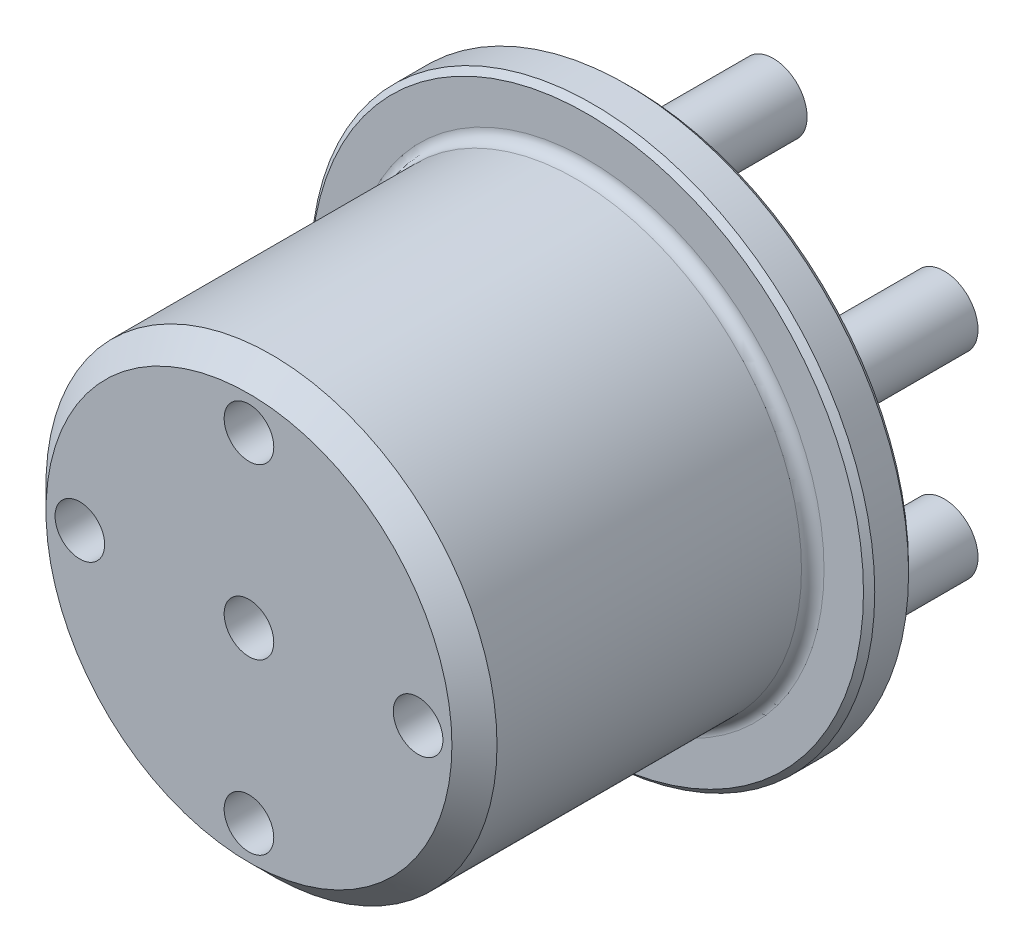
ISO-10303-21;
HEADER;
FILE_DESCRIPTION(('STEP AP214'),'2;1');
FILE_NAME('part.step','',(''),(''),'','','');
FILE_SCHEMA(('AUTOMOTIVE_DESIGN { 1 0 10303 214 1 1 1 1 }'));
ENDSEC;
DATA;
#1=APPLICATION_CONTEXT('core data for automotive mechanical design processes');
#2=APPLICATION_PROTOCOL_DEFINITION('international standard','automotive_design',2000,#1);
#3=PRODUCT_CONTEXT('',#1,'mechanical');
#4=PRODUCT('Part','Part','',(#3));
#5=PRODUCT_RELATED_PRODUCT_CATEGORY('part','',(#4));
#6=PRODUCT_DEFINITION_FORMATION('','',#4);
#7=PRODUCT_DEFINITION_CONTEXT('part definition',#1,'design');
#8=PRODUCT_DEFINITION('design','',#6,#7);
#9=PRODUCT_DEFINITION_SHAPE('','',#8);
#10=(LENGTH_UNIT() NAMED_UNIT(*) SI_UNIT(.MILLI.,.METRE.));
#11=(NAMED_UNIT(*) PLANE_ANGLE_UNIT() SI_UNIT($,.RADIAN.));
#12=(NAMED_UNIT(*) SI_UNIT($,.STERADIAN.) SOLID_ANGLE_UNIT());
#13=UNCERTAINTY_MEASURE_WITH_UNIT(LENGTH_MEASURE(1.E-05),#10,'distance_accuracy_value','');
#14=(GEOMETRIC_REPRESENTATION_CONTEXT(3) GLOBAL_UNCERTAINTY_ASSIGNED_CONTEXT((#13)) GLOBAL_UNIT_ASSIGNED_CONTEXT((#10,
#11,#12)) REPRESENTATION_CONTEXT('',''));
#15=CARTESIAN_POINT('',(0.,0.,0.));
#16=DIRECTION('',(0.,0.,1.));
#17=DIRECTION('',(1.,0.,0.));
#18=AXIS2_PLACEMENT_3D('',#15,#16,#17);
#19=CARTESIAN_POINT('',(0.,0.,-4.));
#20=DIRECTION('',(0.,0.,1.));
#21=DIRECTION('',(1.,0.,0.));
#22=AXIS2_PLACEMENT_3D('',#19,#20,#21);
#23=CYLINDRICAL_SURFACE('',#22,25.);
#24=CARTESIAN_POINT('',(0.,0.,-3.50000000000001));
#25=DIRECTION('',(0.,0.,1.));
#26=DIRECTION('',(1.,0.,0.));
#27=AXIS2_PLACEMENT_3D('',#24,#25,#26);
#28=CIRCLE('',#27,25.);
#29=CARTESIAN_POINT('',(25.,0.,-3.50000000000001));
#30=VERTEX_POINT('',#29);
#31=EDGE_CURVE('E206',#30,#30,#28,.T.);
#32=ORIENTED_EDGE('',*,*,#31,.T.);
#33=EDGE_LOOP('',(#32));
#34=FACE_BOUND('',#33,.T.);
#35=CARTESIAN_POINT('',(0.,0.,-0.499999999999997));
#36=DIRECTION('',(0.,0.,1.));
#37=DIRECTION('',(1.,0.,0.));
#38=AXIS2_PLACEMENT_3D('',#35,#36,#37);
#39=CIRCLE('',#38,25.);
#40=CARTESIAN_POINT('',(25.,0.,-0.499999999999997));
#41=VERTEX_POINT('',#40);
#42=EDGE_CURVE('E202',#41,#41,#39,.F.);
#43=ORIENTED_EDGE('',*,*,#42,.T.);
#44=EDGE_LOOP('',(#43));
#45=FACE_BOUND('',#44,.T.);
#46=ADVANCED_FACE('F47',(#34,#45),#23,.T.);
#47=CARTESIAN_POINT('',(0.,0.,-4.));
#48=DIRECTION('',(0.,0.,1.));
#49=DIRECTION('',(1.,0.,0.));
#50=AXIS2_PLACEMENT_3D('',#47,#48,#49);
#51=PLANE('',#50);
#52=CARTESIAN_POINT('',(0.,0.,-4.));
#53=DIRECTION('',(0.,0.,1.));
#54=DIRECTION('',(1.,0.,0.));
#55=AXIS2_PLACEMENT_3D('',#52,#53,#54);
#56=CIRCLE('',#55,24.5);
#57=CARTESIAN_POINT('',(24.5,0.,-4.));
#58=VERTEX_POINT('',#57);
#59=EDGE_CURVE('E214',#58,#58,#56,.F.);
#60=ORIENTED_EDGE('',*,*,#59,.T.);
#61=EDGE_LOOP('',(#60));
#62=FACE_BOUND('',#61,.T.);
#63=CARTESIAN_POINT('',(0.,0.,-4.));
#64=DIRECTION('',(0.,0.,1.));
#65=DIRECTION('',(1.,0.,0.));
#66=AXIS2_PLACEMENT_3D('',#63,#64,#65);
#67=CIRCLE('',#66,10.7);
#68=CARTESIAN_POINT('',(10.7,0.,-4.));
#69=VERTEX_POINT('',#68);
#70=EDGE_CURVE('E210',#69,#69,#67,.T.);
#71=ORIENTED_EDGE('',*,*,#70,.T.);
#72=EDGE_LOOP('',(#71));
#73=FACE_BOUND('',#72,.T.);
#74=CARTESIAN_POINT('',(15.1554445662276,8.75000000000018,-4.));
#75=DIRECTION('',(0.,0.,1.));
#76=DIRECTION('',(1.,0.,0.));
#77=AXIS2_PLACEMENT_3D('',#74,#75,#76);
#78=CIRCLE('',#77,4.);
#79=CARTESIAN_POINT('',(19.1554445662276,8.75000000000018,-4.));
#80=VERTEX_POINT('',#79);
#81=EDGE_CURVE('E178',#80,#80,#78,.T.);
#82=ORIENTED_EDGE('',*,*,#81,.T.);
#83=EDGE_LOOP('',(#82));
#84=FACE_BOUND('',#83,.T.);
#85=CARTESIAN_POINT('',(0.,17.5,-4.));
#86=DIRECTION('',(0.,0.,1.));
#87=DIRECTION('',(1.,0.,0.));
#88=AXIS2_PLACEMENT_3D('',#85,#86,#87);
#89=CIRCLE('',#88,4.);
#90=CARTESIAN_POINT('',(4.,17.5,-4.));
#91=VERTEX_POINT('',#90);
#92=EDGE_CURVE('E174',#91,#91,#89,.T.);
#93=ORIENTED_EDGE('',*,*,#92,.T.);
#94=EDGE_LOOP('',(#93));
#95=FACE_BOUND('',#94,.T.);
#96=CARTESIAN_POINT('',(-15.1554445662277,8.74999999999997,-4.));
#97=DIRECTION('',(0.,0.,1.));
#98=DIRECTION('',(1.,0.,0.));
#99=AXIS2_PLACEMENT_3D('',#96,#97,#98);
#100=CIRCLE('',#99,4.);
#101=CARTESIAN_POINT('',(-11.1554445662277,8.74999999999997,-4.));
#102=VERTEX_POINT('',#101);
#103=EDGE_CURVE('E170',#102,#102,#100,.T.);
#104=ORIENTED_EDGE('',*,*,#103,.T.);
#105=EDGE_LOOP('',(#104));
#106=FACE_BOUND('',#105,.T.);
#107=CARTESIAN_POINT('',(-15.1554445662276,-8.75000000000007,-4.));
#108=DIRECTION('',(0.,0.,1.));
#109=DIRECTION('',(1.,0.,0.));
#110=AXIS2_PLACEMENT_3D('',#107,#108,#109);
#111=CIRCLE('',#110,4.);
#112=CARTESIAN_POINT('',(-11.1554445662276,-8.75000000000007,-4.));
#113=VERTEX_POINT('',#112);
#114=EDGE_CURVE('E166',#113,#113,#111,.T.);
#115=ORIENTED_EDGE('',*,*,#114,.T.);
#116=EDGE_LOOP('',(#115));
#117=FACE_BOUND('',#116,.T.);
#118=CARTESIAN_POINT('',(1.2220184685951E-13,-17.5,-4.));
#119=DIRECTION('',(0.,0.,1.));
#120=DIRECTION('',(1.,0.,0.));
#121=AXIS2_PLACEMENT_3D('',#118,#119,#120);
#122=CIRCLE('',#121,4.);
#123=CARTESIAN_POINT('',(4.00000000000012,-17.5,-4.));
#124=VERTEX_POINT('',#123);
#125=EDGE_CURVE('E162',#124,#124,#122,.T.);
#126=ORIENTED_EDGE('',*,*,#125,.T.);
#127=EDGE_LOOP('',(#126));
#128=FACE_BOUND('',#127,.T.);
#129=CARTESIAN_POINT('',(15.1554445662277,-8.75000000000001,-4.));
#130=DIRECTION('',(0.,0.,1.));
#131=DIRECTION('',(1.,0.,0.));
#132=AXIS2_PLACEMENT_3D('',#129,#130,#131);
#133=CIRCLE('',#132,4.);
#134=CARTESIAN_POINT('',(19.1554445662277,-8.75000000000001,-4.));
#135=VERTEX_POINT('',#134);
#136=EDGE_CURVE('E158',#135,#135,#133,.T.);
#137=ORIENTED_EDGE('',*,*,#136,.T.);
#138=EDGE_LOOP('',(#137));
#139=FACE_BOUND('',#138,.T.);
#140=ADVANCED_FACE('F251',(#62,#73,#84,#95,#106,#117,#128,#139),#51,.F.);
#141=CARTESIAN_POINT('',(0.,0.,0.));
#142=DIRECTION('',(0.,0.,1.));
#143=DIRECTION('',(1.,0.,0.));
#144=AXIS2_PLACEMENT_3D('',#141,#142,#143);
#145=PLANE('',#144);
#146=CARTESIAN_POINT('',(0.,0.,0.));
#147=DIRECTION('',(0.,0.,1.));
#148=DIRECTION('',(1.,0.,0.));
#149=AXIS2_PLACEMENT_3D('',#146,#147,#148);
#150=CIRCLE('',#149,24.5);
#151=CARTESIAN_POINT('',(24.5,0.,0.));
#152=VERTEX_POINT('',#151);
#153=EDGE_CURVE('E230',#152,#152,#150,.T.);
#154=ORIENTED_EDGE('',*,*,#153,.T.);
#155=EDGE_LOOP('',(#154));
#156=FACE_BOUND('',#155,.T.);
#157=CARTESIAN_POINT('',(0.,0.,0.));
#158=DIRECTION('',(0.,0.,1.));
#159=DIRECTION('',(1.,0.,0.));
#160=AXIS2_PLACEMENT_3D('',#157,#158,#159);
#161=CIRCLE('',#160,21.);
#162=CARTESIAN_POINT('',(21.,0.,0.));
#163=VERTEX_POINT('',#162);
#164=EDGE_CURVE('E150',#163,#163,#161,.F.);
#165=ORIENTED_EDGE('',*,*,#164,.T.);
#166=EDGE_LOOP('',(#165));
#167=FACE_BOUND('',#166,.T.);
#168=ADVANCED_FACE('F258',(#156,#167),#145,.T.);
#169=CARTESIAN_POINT('',(0.,0.,30.));
#170=DIRECTION('',(0.,0.,-1.));
#171=DIRECTION('',(-1.,0.,0.));
#172=AXIS2_PLACEMENT_3D('',#169,#170,#171);
#173=CYLINDRICAL_SURFACE('',#172,20.);
#174=CARTESIAN_POINT('',(0.,0.,28.));
#175=DIRECTION('',(0.,0.,1.));
#176=DIRECTION('',(1.,0.,0.));
#177=AXIS2_PLACEMENT_3D('',#174,#175,#176);
#178=CIRCLE('',#177,20.);
#179=CARTESIAN_POINT('',(20.,0.,28.));
#180=VERTEX_POINT('',#179);
#181=EDGE_CURVE('E11',#180,#180,#178,.F.);
#182=ORIENTED_EDGE('',*,*,#181,.T.);
#183=EDGE_LOOP('',(#182));
#184=FACE_BOUND('',#183,.T.);
#185=CARTESIAN_POINT('',(0.,0.,1.));
#186=DIRECTION('',(0.,0.,1.));
#187=DIRECTION('',(1.,0.,0.));
#188=AXIS2_PLACEMENT_3D('',#185,#186,#187);
#189=CIRCLE('',#188,20.);
#190=CARTESIAN_POINT('',(20.,0.,1.));
#191=VERTEX_POINT('',#190);
#192=EDGE_CURVE('E127',#191,#191,#189,.T.);
#193=ORIENTED_EDGE('',*,*,#192,.T.);
#194=EDGE_LOOP('',(#193));
#195=FACE_BOUND('',#194,.T.);
#196=ADVANCED_FACE('F340',(#184,#195),#173,.T.);
#197=CARTESIAN_POINT('',(0.,0.,30.));
#198=DIRECTION('',(0.,0.,1.));
#199=DIRECTION('',(1.,0.,0.));
#200=AXIS2_PLACEMENT_3D('',#197,#198,#199);
#201=PLANE('',#200);
#202=CARTESIAN_POINT('',(0.,0.,30.));
#203=DIRECTION('',(0.,0.,1.));
#204=DIRECTION('',(1.,0.,0.));
#205=AXIS2_PLACEMENT_3D('',#202,#203,#204);
#206=CIRCLE('',#205,18.);
#207=CARTESIAN_POINT('',(18.,0.,30.));
#208=VERTEX_POINT('',#207);
#209=EDGE_CURVE('E57',#208,#208,#206,.T.);
#210=ORIENTED_EDGE('',*,*,#209,.T.);
#211=EDGE_LOOP('',(#210));
#212=FACE_BOUND('',#211,.T.);
#213=CARTESIAN_POINT('',(0.,0.,30.));
#214=DIRECTION('',(0.,0.,1.));
#215=DIRECTION('',(1.,0.,0.));
#216=AXIS2_PLACEMENT_3D('',#213,#214,#215);
#217=CIRCLE('',#216,2.2);
#218=CARTESIAN_POINT('',(2.2,0.,30.));
#219=VERTEX_POINT('',#218);
#220=EDGE_CURVE('E85',#219,#219,#217,.T.);
#221=ORIENTED_EDGE('',*,*,#220,.F.);
#222=EDGE_LOOP('',(#221));
#223=FACE_BOUND('',#222,.T.);
#224=CARTESIAN_POINT('',(0.,15.,30.));
#225=DIRECTION('',(0.,0.,1.));
#226=DIRECTION('',(1.,0.,0.));
#227=AXIS2_PLACEMENT_3D('',#224,#225,#226);
#228=CIRCLE('',#227,2.2);
#229=CARTESIAN_POINT('',(2.2,15.,30.));
#230=VERTEX_POINT('',#229);
#231=EDGE_CURVE('E84',#230,#230,#228,.T.);
#232=ORIENTED_EDGE('',*,*,#231,.F.);
#233=EDGE_LOOP('',(#232));
#234=FACE_BOUND('',#233,.T.);
#235=CARTESIAN_POINT('',(15.,0.,30.));
#236=DIRECTION('',(0.,0.,1.));
#237=DIRECTION('',(1.,0.,0.));
#238=AXIS2_PLACEMENT_3D('',#235,#236,#237);
#239=CIRCLE('',#238,2.2);
#240=CARTESIAN_POINT('',(17.2,0.,30.));
#241=VERTEX_POINT('',#240);
#242=EDGE_CURVE('E98',#241,#241,#239,.T.);
#243=ORIENTED_EDGE('',*,*,#242,.F.);
#244=EDGE_LOOP('',(#243));
#245=FACE_BOUND('',#244,.T.);
#246=CARTESIAN_POINT('',(0.,-15.,30.));
#247=DIRECTION('',(0.,0.,1.));
#248=DIRECTION('',(1.,0.,0.));
#249=AXIS2_PLACEMENT_3D('',#246,#247,#248);
#250=CIRCLE('',#249,2.2);
#251=CARTESIAN_POINT('',(2.2,-15.,30.));
#252=VERTEX_POINT('',#251);
#253=EDGE_CURVE('E106',#252,#252,#250,.T.);
#254=ORIENTED_EDGE('',*,*,#253,.F.);
#255=EDGE_LOOP('',(#254));
#256=FACE_BOUND('',#255,.T.);
#257=CARTESIAN_POINT('',(-15.,0.,30.));
#258=DIRECTION('',(0.,0.,1.));
#259=DIRECTION('',(1.,0.,0.));
#260=AXIS2_PLACEMENT_3D('',#257,#258,#259);
#261=CIRCLE('',#260,2.2);
#262=CARTESIAN_POINT('',(-12.8,0.,30.));
#263=VERTEX_POINT('',#262);
#264=EDGE_CURVE('E114',#263,#263,#261,.T.);
#265=ORIENTED_EDGE('',*,*,#264,.F.);
#266=EDGE_LOOP('',(#265));
#267=FACE_BOUND('',#266,.T.);
#268=ADVANCED_FACE('F237',(#212,#223,#234,#245,#256,#267),#201,.T.);
#269=CARTESIAN_POINT('',(0.,0.,1.));
#270=DIRECTION('',(0.,0.,1.));
#271=DIRECTION('',(1.,0.,0.));
#272=AXIS2_PLACEMENT_3D('',#269,#270,#271);
#273=TOROIDAL_SURFACE('',#272,21.,1.);
#274=ORIENTED_EDGE('',*,*,#164,.F.);
#275=EDGE_LOOP('',(#274));
#276=FACE_BOUND('',#275,.T.);
#277=ORIENTED_EDGE('',*,*,#192,.F.);
#278=EDGE_LOOP('',(#277));
#279=FACE_BOUND('',#278,.T.);
#280=ADVANCED_FACE('F264',(#276,#279),#273,.F.);
#281=CARTESIAN_POINT('',(0.,0.,1.));
#282=DIRECTION('',(0.,0.,-1.));
#283=DIRECTION('',(-1.,0.,0.));
#284=AXIS2_PLACEMENT_3D('',#281,#282,#283);
#285=CYLINDRICAL_SURFACE('',#284,10.2);
#286=CARTESIAN_POINT('',(0.,0.,-3.50000000000001));
#287=DIRECTION('',(0.,0.,1.));
#288=DIRECTION('',(1.,0.,0.));
#289=AXIS2_PLACEMENT_3D('',#286,#287,#288);
#290=CIRCLE('',#289,10.2);
#291=CARTESIAN_POINT('',(10.2,0.,-3.50000000000001));
#292=VERTEX_POINT('',#291);
#293=EDGE_CURVE('E222',#292,#292,#290,.F.);
#294=ORIENTED_EDGE('',*,*,#293,.T.);
#295=EDGE_LOOP('',(#294));
#296=FACE_BOUND('',#295,.T.);
#297=CARTESIAN_POINT('',(0.,0.,0.50000000000001));
#298=DIRECTION('',(0.,0.,-1.));
#299=DIRECTION('',(-1.,0.,0.));
#300=AXIS2_PLACEMENT_3D('',#297,#298,#299);
#301=CIRCLE('',#300,10.2);
#302=CARTESIAN_POINT('',(-10.2,0.,0.50000000000001));
#303=VERTEX_POINT('',#302);
#304=EDGE_CURVE('E218',#303,#303,#301,.F.);
#305=ORIENTED_EDGE('',*,*,#304,.T.);
#306=EDGE_LOOP('',(#305));
#307=FACE_BOUND('',#306,.T.);
#308=ADVANCED_FACE('F267',(#296,#307),#285,.F.);
#309=CARTESIAN_POINT('',(0.,0.,1.));
#310=DIRECTION('',(0.,0.,-1.));
#311=DIRECTION('',(-1.,0.,0.));
#312=AXIS2_PLACEMENT_3D('',#309,#310,#311);
#313=PLANE('',#312);
#314=CARTESIAN_POINT('',(0.,0.,1.));
#315=DIRECTION('',(0.,0.,-1.));
#316=DIRECTION('',(-1.,0.,0.));
#317=AXIS2_PLACEMENT_3D('',#314,#315,#316);
#318=CIRCLE('',#317,9.7);
#319=CARTESIAN_POINT('',(-9.7,0.,1.));
#320=VERTEX_POINT('',#319);
#321=EDGE_CURVE('E226',#320,#320,#318,.T.);
#322=ORIENTED_EDGE('',*,*,#321,.T.);
#323=EDGE_LOOP('',(#322));
#324=FACE_BOUND('',#323,.T.);
#325=ADVANCED_FACE('F322',(#324),#313,.T.);
#326=CARTESIAN_POINT('',(-15.1554445662277,8.74999999999997,-16.5));
#327=DIRECTION('',(0.,0.,1.));
#328=DIRECTION('',(1.,0.,0.));
#329=AXIS2_PLACEMENT_3D('',#326,#327,#328);
#330=CYLINDRICAL_SURFACE('',#329,3.);
#331=CARTESIAN_POINT('',(-15.1554445662277,8.74999999999997,-5.));
#332=DIRECTION('',(0.,0.,1.));
#333=DIRECTION('',(1.,0.,0.));
#334=AXIS2_PLACEMENT_3D('',#331,#332,#333);
#335=CIRCLE('',#334,3.);
#336=CARTESIAN_POINT('',(-12.1554445662277,8.74999999999997,-5.));
#337=VERTEX_POINT('',#336);
#338=EDGE_CURVE('E186',#337,#337,#335,.F.);
#339=ORIENTED_EDGE('',*,*,#338,.T.);
#340=EDGE_LOOP('',(#339));
#341=FACE_BOUND('',#340,.T.);
#342=CARTESIAN_POINT('',(-15.1554445662277,8.74999999999997,-16.5));
#343=DIRECTION('',(0.,0.,-1.));
#344=DIRECTION('',(-1.,0.,0.));
#345=AXIS2_PLACEMENT_3D('',#342,#343,#344);
#346=CIRCLE('',#345,3.);
#347=CARTESIAN_POINT('',(-18.1554445662277,8.74999999999997,-16.5));
#348=VERTEX_POINT('',#347);
#349=EDGE_CURVE('E128',#348,#348,#346,.T.);
#350=ORIENTED_EDGE('',*,*,#349,.F.);
#351=EDGE_LOOP('',(#350));
#352=FACE_BOUND('',#351,.T.);
#353=ADVANCED_FACE('F324',(#341,#352),#330,.T.);
#354=CARTESIAN_POINT('',(-15.1554445662277,8.74999999999997,-16.5));
#355=DIRECTION('',(0.,0.,-1.));
#356=DIRECTION('',(-1.,0.,0.));
#357=AXIS2_PLACEMENT_3D('',#354,#355,#356);
#358=PLANE('',#357);
#359=ORIENTED_EDGE('',*,*,#349,.T.);
#360=EDGE_LOOP('',(#359));
#361=FACE_BOUND('',#360,.T.);
#362=ADVANCED_FACE('F330',(#361),#358,.T.);
#363=CARTESIAN_POINT('',(-15.1554445662276,-8.75000000000007,-16.5));
#364=DIRECTION('',(0.,0.,1.));
#365=DIRECTION('',(1.,0.,0.));
#366=AXIS2_PLACEMENT_3D('',#363,#364,#365);
#367=CYLINDRICAL_SURFACE('',#366,3.);
#368=CARTESIAN_POINT('',(-15.1554445662276,-8.75000000000007,-5.));
#369=DIRECTION('',(0.,0.,1.));
#370=DIRECTION('',(1.,0.,0.));
#371=AXIS2_PLACEMENT_3D('',#368,#369,#370);
#372=CIRCLE('',#371,3.);
#373=CARTESIAN_POINT('',(-12.1554445662276,-8.75000000000007,-5.));
#374=VERTEX_POINT('',#373);
#375=EDGE_CURVE('E190',#374,#374,#372,.F.);
#376=ORIENTED_EDGE('',*,*,#375,.T.);
#377=EDGE_LOOP('',(#376));
#378=FACE_BOUND('',#377,.T.);
#379=CARTESIAN_POINT('',(-15.1554445662276,-8.75000000000007,-16.5));
#380=DIRECTION('',(0.,0.,-1.));
#381=DIRECTION('',(-1.,0.,0.));
#382=AXIS2_PLACEMENT_3D('',#379,#380,#381);
#383=CIRCLE('',#382,3.);
#384=CARTESIAN_POINT('',(-18.1554445662276,-8.75000000000007,-16.5));
#385=VERTEX_POINT('',#384);
#386=EDGE_CURVE('E136',#385,#385,#383,.T.);
#387=ORIENTED_EDGE('',*,*,#386,.F.);
#388=EDGE_LOOP('',(#387));
#389=FACE_BOUND('',#388,.T.);
#390=ADVANCED_FACE('F390',(#378,#389),#367,.T.);
#391=CARTESIAN_POINT('',(-15.1554445662276,-8.75000000000007,-16.5));
#392=DIRECTION('',(0.,0.,-1.));
#393=DIRECTION('',(-1.,0.,0.));
#394=AXIS2_PLACEMENT_3D('',#391,#392,#393);
#395=PLANE('',#394);
#396=ORIENTED_EDGE('',*,*,#386,.T.);
#397=EDGE_LOOP('',(#396));
#398=FACE_BOUND('',#397,.T.);
#399=ADVANCED_FACE('F400',(#398),#395,.T.);
#400=CARTESIAN_POINT('',(1.2220184685951E-13,-17.5,-16.5));
#401=DIRECTION('',(0.,0.,1.));
#402=DIRECTION('',(1.,0.,0.));
#403=AXIS2_PLACEMENT_3D('',#400,#401,#402);
#404=CYLINDRICAL_SURFACE('',#403,3.);
#405=CARTESIAN_POINT('',(1.2220184685951E-13,-17.5,-5.));
#406=DIRECTION('',(0.,0.,1.));
#407=DIRECTION('',(1.,0.,0.));
#408=AXIS2_PLACEMENT_3D('',#405,#406,#407);
#409=CIRCLE('',#408,3.);
#410=CARTESIAN_POINT('',(3.00000000000012,-17.5,-5.));
#411=VERTEX_POINT('',#410);
#412=EDGE_CURVE('E194',#411,#411,#409,.F.);
#413=ORIENTED_EDGE('',*,*,#412,.T.);
#414=EDGE_LOOP('',(#413));
#415=FACE_BOUND('',#414,.T.);
#416=CARTESIAN_POINT('',(1.2220184685951E-13,-17.5,-16.5));
#417=DIRECTION('',(0.,0.,-1.));
#418=DIRECTION('',(-1.,0.,0.));
#419=AXIS2_PLACEMENT_3D('',#416,#417,#418);
#420=CIRCLE('',#419,3.);
#421=CARTESIAN_POINT('',(-2.99999999999988,-17.5,-16.5));
#422=VERTEX_POINT('',#421);
#423=EDGE_CURVE('E140',#422,#422,#420,.T.);
#424=ORIENTED_EDGE('',*,*,#423,.F.);
#425=EDGE_LOOP('',(#424));
#426=FACE_BOUND('',#425,.T.);
#427=ADVANCED_FACE('F410',(#415,#426),#404,.T.);
#428=CARTESIAN_POINT('',(1.2220184685951E-13,-17.5,-16.5));
#429=DIRECTION('',(0.,0.,-1.));
#430=DIRECTION('',(-1.,0.,0.));
#431=AXIS2_PLACEMENT_3D('',#428,#429,#430);
#432=PLANE('',#431);
#433=ORIENTED_EDGE('',*,*,#423,.T.);
#434=EDGE_LOOP('',(#433));
#435=FACE_BOUND('',#434,.T.);
#436=ADVANCED_FACE('F420',(#435),#432,.T.);
#437=CARTESIAN_POINT('',(15.1554445662276,8.75000000000018,-16.5));
#438=DIRECTION('',(0.,0.,1.));
#439=DIRECTION('',(1.,0.,0.));
#440=AXIS2_PLACEMENT_3D('',#437,#438,#439);
#441=CYLINDRICAL_SURFACE('',#440,3.);
#442=CARTESIAN_POINT('',(15.1554445662276,8.75000000000018,-5.));
#443=DIRECTION('',(0.,0.,1.));
#444=DIRECTION('',(1.,0.,0.));
#445=AXIS2_PLACEMENT_3D('',#442,#443,#444);
#446=CIRCLE('',#445,3.);
#447=CARTESIAN_POINT('',(18.1554445662276,8.75000000000018,-5.));
#448=VERTEX_POINT('',#447);
#449=EDGE_CURVE('E154',#448,#448,#446,.F.);
#450=ORIENTED_EDGE('',*,*,#449,.T.);
#451=EDGE_LOOP('',(#450));
#452=FACE_BOUND('',#451,.T.);
#453=CARTESIAN_POINT('',(15.1554445662276,8.75000000000018,-16.5));
#454=DIRECTION('',(0.,0.,-1.));
#455=DIRECTION('',(-1.,0.,0.));
#456=AXIS2_PLACEMENT_3D('',#453,#454,#455);
#457=CIRCLE('',#456,3.);
#458=CARTESIAN_POINT('',(12.1554445662276,8.75000000000018,-16.5));
#459=VERTEX_POINT('',#458);
#460=EDGE_CURVE('E122',#459,#459,#457,.T.);
#461=ORIENTED_EDGE('',*,*,#460,.F.);
#462=EDGE_LOOP('',(#461));
#463=FACE_BOUND('',#462,.T.);
#464=ADVANCED_FACE('F430',(#452,#463),#441,.T.);
#465=CARTESIAN_POINT('',(15.1554445662276,8.75000000000018,-16.5));
#466=DIRECTION('',(0.,0.,-1.));
#467=DIRECTION('',(-1.,0.,0.));
#468=AXIS2_PLACEMENT_3D('',#465,#466,#467);
#469=PLANE('',#468);
#470=ORIENTED_EDGE('',*,*,#460,.T.);
#471=EDGE_LOOP('',(#470));
#472=FACE_BOUND('',#471,.T.);
#473=ADVANCED_FACE('F440',(#472),#469,.T.);
#474=CARTESIAN_POINT('',(0.,17.5,-16.5));
#475=DIRECTION('',(0.,0.,1.));
#476=DIRECTION('',(1.,0.,0.));
#477=AXIS2_PLACEMENT_3D('',#474,#475,#476);
#478=CYLINDRICAL_SURFACE('',#477,3.);
#479=CARTESIAN_POINT('',(0.,17.5,-5.));
#480=DIRECTION('',(0.,0.,1.));
#481=DIRECTION('',(1.,0.,0.));
#482=AXIS2_PLACEMENT_3D('',#479,#480,#481);
#483=CIRCLE('',#482,3.);
#484=CARTESIAN_POINT('',(3.,17.5,-5.));
#485=VERTEX_POINT('',#484);
#486=EDGE_CURVE('E182',#485,#485,#483,.F.);
#487=ORIENTED_EDGE('',*,*,#486,.T.);
#488=EDGE_LOOP('',(#487));
#489=FACE_BOUND('',#488,.T.);
#490=CARTESIAN_POINT('',(0.,17.5,-16.5));
#491=DIRECTION('',(0.,0.,-1.));
#492=DIRECTION('',(-1.,0.,0.));
#493=AXIS2_PLACEMENT_3D('',#490,#491,#492);
#494=CIRCLE('',#493,3.);
#495=CARTESIAN_POINT('',(-3.,17.5,-16.5));
#496=VERTEX_POINT('',#495);
#497=EDGE_CURVE('E123',#496,#496,#494,.T.);
#498=ORIENTED_EDGE('',*,*,#497,.F.);
#499=EDGE_LOOP('',(#498));
#500=FACE_BOUND('',#499,.T.);
#501=ADVANCED_FACE('F450',(#489,#500),#478,.T.);
#502=CARTESIAN_POINT('',(0.,17.5,-16.5));
#503=DIRECTION('',(0.,0.,-1.));
#504=DIRECTION('',(-1.,0.,0.));
#505=AXIS2_PLACEMENT_3D('',#502,#503,#504);
#506=PLANE('',#505);
#507=ORIENTED_EDGE('',*,*,#497,.T.);
#508=EDGE_LOOP('',(#507));
#509=FACE_BOUND('',#508,.T.);
#510=ADVANCED_FACE('F460',(#509),#506,.T.);
#511=CARTESIAN_POINT('',(15.1554445662277,-8.75000000000001,-16.5));
#512=DIRECTION('',(0.,0.,1.));
#513=DIRECTION('',(1.,0.,0.));
#514=AXIS2_PLACEMENT_3D('',#511,#512,#513);
#515=CYLINDRICAL_SURFACE('',#514,3.);
#516=CARTESIAN_POINT('',(15.1554445662277,-8.75000000000001,-5.));
#517=DIRECTION('',(0.,0.,1.));
#518=DIRECTION('',(1.,0.,0.));
#519=AXIS2_PLACEMENT_3D('',#516,#517,#518);
#520=CIRCLE('',#519,3.);
#521=CARTESIAN_POINT('',(18.1554445662277,-8.75000000000001,-5.));
#522=VERTEX_POINT('',#521);
#523=EDGE_CURVE('E198',#522,#522,#520,.F.);
#524=ORIENTED_EDGE('',*,*,#523,.T.);
#525=EDGE_LOOP('',(#524));
#526=FACE_BOUND('',#525,.T.);
#527=CARTESIAN_POINT('',(15.1554445662277,-8.75000000000001,-16.5));
#528=DIRECTION('',(0.,0.,-1.));
#529=DIRECTION('',(-1.,0.,0.));
#530=AXIS2_PLACEMENT_3D('',#527,#528,#529);
#531=CIRCLE('',#530,3.);
#532=CARTESIAN_POINT('',(12.1554445662277,-8.75000000000001,-16.5));
#533=VERTEX_POINT('',#532);
#534=EDGE_CURVE('E132',#533,#533,#531,.T.);
#535=ORIENTED_EDGE('',*,*,#534,.F.);
#536=EDGE_LOOP('',(#535));
#537=FACE_BOUND('',#536,.T.);
#538=ADVANCED_FACE('F470',(#526,#537),#515,.T.);
#539=CARTESIAN_POINT('',(15.1554445662277,-8.75000000000001,-16.5));
#540=DIRECTION('',(0.,0.,-1.));
#541=DIRECTION('',(-1.,0.,0.));
#542=AXIS2_PLACEMENT_3D('',#539,#540,#541);
#543=PLANE('',#542);
#544=ORIENTED_EDGE('',*,*,#534,.T.);
#545=EDGE_LOOP('',(#544));
#546=FACE_BOUND('',#545,.T.);
#547=ADVANCED_FACE('F336',(#546),#543,.T.);
#548=CARTESIAN_POINT('',(-15.,0.,22.));
#549=DIRECTION('',(0.,0.,1.));
#550=DIRECTION('',(1.,0.,0.));
#551=AXIS2_PLACEMENT_3D('',#548,#549,#550);
#552=CONICAL_SURFACE('',#551,2.2,1.02974425867665);
#553=CARTESIAN_POINT('',(-15.,0.,20.6781066381394));
#554=VERTEX_POINT('',#553);
#555=VERTEX_LOOP('',#554);
#556=FACE_BOUND('',#555,.T.);
#557=CARTESIAN_POINT('',(-15.,0.,22.));
#558=DIRECTION('',(0.,0.,1.));
#559=DIRECTION('',(1.,0.,0.));
#560=AXIS2_PLACEMENT_3D('',#557,#558,#559);
#561=CIRCLE('',#560,2.2);
#562=CARTESIAN_POINT('',(-12.8,0.,22.));
#563=VERTEX_POINT('',#562);
#564=EDGE_CURVE('E118',#563,#563,#561,.T.);
#565=ORIENTED_EDGE('',*,*,#564,.T.);
#566=EDGE_LOOP('',(#565));
#567=FACE_BOUND('',#566,.T.);
#568=ADVANCED_FACE('F487',(#556,#567),#552,.F.);
#569=CARTESIAN_POINT('',(-15.,0.,30.));
#570=DIRECTION('',(0.,0.,1.));
#571=DIRECTION('',(1.,0.,0.));
#572=AXIS2_PLACEMENT_3D('',#569,#570,#571);
#573=CYLINDRICAL_SURFACE('',#572,2.2);
#574=ORIENTED_EDGE('',*,*,#564,.F.);
#575=EDGE_LOOP('',(#574));
#576=FACE_BOUND('',#575,.T.);
#577=ORIENTED_EDGE('',*,*,#264,.T.);
#578=EDGE_LOOP('',(#577));
#579=FACE_BOUND('',#578,.T.);
#580=ADVANCED_FACE('F496',(#576,#579),#573,.F.);
#581=CARTESIAN_POINT('',(0.,-15.,22.));
#582=DIRECTION('',(0.,0.,1.));
#583=DIRECTION('',(1.,0.,0.));
#584=AXIS2_PLACEMENT_3D('',#581,#582,#583);
#585=CONICAL_SURFACE('',#584,2.2,1.02974425867665);
#586=CARTESIAN_POINT('',(0.,-15.,20.6781066381394));
#587=VERTEX_POINT('',#586);
#588=VERTEX_LOOP('',#587);
#589=FACE_BOUND('',#588,.T.);
#590=CARTESIAN_POINT('',(0.,-15.,22.));
#591=DIRECTION('',(0.,0.,1.));
#592=DIRECTION('',(1.,0.,0.));
#593=AXIS2_PLACEMENT_3D('',#590,#591,#592);
#594=CIRCLE('',#593,2.2);
#595=CARTESIAN_POINT('',(2.2,-15.,22.));
#596=VERTEX_POINT('',#595);
#597=EDGE_CURVE('E110',#596,#596,#594,.T.);
#598=ORIENTED_EDGE('',*,*,#597,.T.);
#599=EDGE_LOOP('',(#598));
#600=FACE_BOUND('',#599,.T.);
#601=ADVANCED_FACE('F505',(#589,#600),#585,.F.);
#602=CARTESIAN_POINT('',(0.,-15.,30.));
#603=DIRECTION('',(0.,0.,1.));
#604=DIRECTION('',(1.,0.,0.));
#605=AXIS2_PLACEMENT_3D('',#602,#603,#604);
#606=CYLINDRICAL_SURFACE('',#605,2.2);
#607=ORIENTED_EDGE('',*,*,#597,.F.);
#608=EDGE_LOOP('',(#607));
#609=FACE_BOUND('',#608,.T.);
#610=ORIENTED_EDGE('',*,*,#253,.T.);
#611=EDGE_LOOP('',(#610));
#612=FACE_BOUND('',#611,.T.);
#613=ADVANCED_FACE('F515',(#609,#612),#606,.F.);
#614=CARTESIAN_POINT('',(15.,0.,22.));
#615=DIRECTION('',(0.,0.,1.));
#616=DIRECTION('',(1.,0.,0.));
#617=AXIS2_PLACEMENT_3D('',#614,#615,#616);
#618=CONICAL_SURFACE('',#617,2.2,1.02974425867665);
#619=CARTESIAN_POINT('',(15.,0.,20.6781066381394));
#620=VERTEX_POINT('',#619);
#621=VERTEX_LOOP('',#620);
#622=FACE_BOUND('',#621,.T.);
#623=CARTESIAN_POINT('',(15.,0.,22.));
#624=DIRECTION('',(0.,0.,1.));
#625=DIRECTION('',(1.,0.,0.));
#626=AXIS2_PLACEMENT_3D('',#623,#624,#625);
#627=CIRCLE('',#626,2.2);
#628=CARTESIAN_POINT('',(17.2,0.,22.));
#629=VERTEX_POINT('',#628);
#630=EDGE_CURVE('E102',#629,#629,#627,.T.);
#631=ORIENTED_EDGE('',*,*,#630,.T.);
#632=EDGE_LOOP('',(#631));
#633=FACE_BOUND('',#632,.T.);
#634=ADVANCED_FACE('F524',(#622,#633),#618,.F.);
#635=CARTESIAN_POINT('',(15.,0.,30.));
#636=DIRECTION('',(0.,0.,1.));
#637=DIRECTION('',(1.,0.,0.));
#638=AXIS2_PLACEMENT_3D('',#635,#636,#637);
#639=CYLINDRICAL_SURFACE('',#638,2.2);
#640=ORIENTED_EDGE('',*,*,#630,.F.);
#641=EDGE_LOOP('',(#640));
#642=FACE_BOUND('',#641,.T.);
#643=ORIENTED_EDGE('',*,*,#242,.T.);
#644=EDGE_LOOP('',(#643));
#645=FACE_BOUND('',#644,.T.);
#646=ADVANCED_FACE('F534',(#642,#645),#639,.F.);
#647=CARTESIAN_POINT('',(0.,15.,22.));
#648=DIRECTION('',(0.,0.,1.));
#649=DIRECTION('',(1.,0.,0.));
#650=AXIS2_PLACEMENT_3D('',#647,#648,#649);
#651=CONICAL_SURFACE('',#650,2.2,1.02974425867665);
#652=CARTESIAN_POINT('',(0.,15.,20.6781066381394));
#653=VERTEX_POINT('',#652);
#654=VERTEX_LOOP('',#653);
#655=FACE_BOUND('',#654,.T.);
#656=CARTESIAN_POINT('',(0.,15.,22.));
#657=DIRECTION('',(0.,0.,1.));
#658=DIRECTION('',(1.,0.,0.));
#659=AXIS2_PLACEMENT_3D('',#656,#657,#658);
#660=CIRCLE('',#659,2.2);
#661=CARTESIAN_POINT('',(2.2,15.,22.));
#662=VERTEX_POINT('',#661);
#663=EDGE_CURVE('E90',#662,#662,#660,.T.);
#664=ORIENTED_EDGE('',*,*,#663,.T.);
#665=EDGE_LOOP('',(#664));
#666=FACE_BOUND('',#665,.T.);
#667=ADVANCED_FACE('F544',(#655,#666),#651,.F.);
#668=CARTESIAN_POINT('',(0.,15.,30.));
#669=DIRECTION('',(0.,0.,1.));
#670=DIRECTION('',(1.,0.,0.));
#671=AXIS2_PLACEMENT_3D('',#668,#669,#670);
#672=CYLINDRICAL_SURFACE('',#671,2.2);
#673=ORIENTED_EDGE('',*,*,#663,.F.);
#674=EDGE_LOOP('',(#673));
#675=FACE_BOUND('',#674,.T.);
#676=ORIENTED_EDGE('',*,*,#231,.T.);
#677=EDGE_LOOP('',(#676));
#678=FACE_BOUND('',#677,.T.);
#679=ADVANCED_FACE('F77',(#675,#678),#672,.F.);
#680=CARTESIAN_POINT('',(0.,0.,22.));
#681=DIRECTION('',(0.,0.,1.));
#682=DIRECTION('',(1.,0.,0.));
#683=AXIS2_PLACEMENT_3D('',#680,#681,#682);
#684=CONICAL_SURFACE('',#683,2.2,1.02974425867665);
#685=CARTESIAN_POINT('',(0.,0.,20.6781066381394));
#686=VERTEX_POINT('',#685);
#687=VERTEX_LOOP('',#686);
#688=FACE_BOUND('',#687,.T.);
#689=CARTESIAN_POINT('',(0.,0.,22.));
#690=DIRECTION('',(0.,0.,1.));
#691=DIRECTION('',(1.,0.,0.));
#692=AXIS2_PLACEMENT_3D('',#689,#690,#691);
#693=CIRCLE('',#692,2.2);
#694=CARTESIAN_POINT('',(2.2,0.,22.));
#695=VERTEX_POINT('',#694);
#696=EDGE_CURVE('E81',#695,#695,#693,.T.);
#697=ORIENTED_EDGE('',*,*,#696,.T.);
#698=EDGE_LOOP('',(#697));
#699=FACE_BOUND('',#698,.T.);
#700=ADVANCED_FACE('F73',(#688,#699),#684,.F.);
#701=CARTESIAN_POINT('',(0.,0.,30.));
#702=DIRECTION('',(0.,0.,1.));
#703=DIRECTION('',(1.,0.,0.));
#704=AXIS2_PLACEMENT_3D('',#701,#702,#703);
#705=CYLINDRICAL_SURFACE('',#704,2.2);
#706=ORIENTED_EDGE('',*,*,#696,.F.);
#707=EDGE_LOOP('',(#706));
#708=FACE_BOUND('',#707,.T.);
#709=ORIENTED_EDGE('',*,*,#220,.T.);
#710=EDGE_LOOP('',(#709));
#711=FACE_BOUND('',#710,.T.);
#712=ADVANCED_FACE('F76',(#708,#711),#705,.F.);
#713=CARTESIAN_POINT('',(15.1554445662276,8.75000000000018,-5.));
#714=DIRECTION('',(0.,0.,1.));
#715=DIRECTION('',(1.,0.,0.));
#716=AXIS2_PLACEMENT_3D('',#713,#714,#715);
#717=TOROIDAL_SURFACE('',#716,4.,1.);
#718=ORIENTED_EDGE('',*,*,#81,.F.);
#719=EDGE_LOOP('',(#718));
#720=FACE_BOUND('',#719,.T.);
#721=ORIENTED_EDGE('',*,*,#449,.F.);
#722=EDGE_LOOP('',(#721));
#723=FACE_BOUND('',#722,.T.);
#724=ADVANCED_FACE('F269',(#720,#723),#717,.F.);
#725=CARTESIAN_POINT('',(0.,17.5,-5.));
#726=DIRECTION('',(0.,0.,1.));
#727=DIRECTION('',(1.,0.,0.));
#728=AXIS2_PLACEMENT_3D('',#725,#726,#727);
#729=TOROIDAL_SURFACE('',#728,4.,1.);
#730=ORIENTED_EDGE('',*,*,#92,.F.);
#731=EDGE_LOOP('',(#730));
#732=FACE_BOUND('',#731,.T.);
#733=ORIENTED_EDGE('',*,*,#486,.F.);
#734=EDGE_LOOP('',(#733));
#735=FACE_BOUND('',#734,.T.);
#736=ADVANCED_FACE('F272',(#732,#735),#729,.F.);
#737=CARTESIAN_POINT('',(-15.1554445662277,8.74999999999997,-5.));
#738=DIRECTION('',(0.,0.,1.));
#739=DIRECTION('',(1.,0.,0.));
#740=AXIS2_PLACEMENT_3D('',#737,#738,#739);
#741=TOROIDAL_SURFACE('',#740,4.,1.);
#742=ORIENTED_EDGE('',*,*,#103,.F.);
#743=EDGE_LOOP('',(#742));
#744=FACE_BOUND('',#743,.T.);
#745=ORIENTED_EDGE('',*,*,#338,.F.);
#746=EDGE_LOOP('',(#745));
#747=FACE_BOUND('',#746,.T.);
#748=ADVANCED_FACE('F276',(#744,#747),#741,.F.);
#749=CARTESIAN_POINT('',(-15.1554445662276,-8.75000000000007,-5.));
#750=DIRECTION('',(0.,0.,1.));
#751=DIRECTION('',(1.,0.,0.));
#752=AXIS2_PLACEMENT_3D('',#749,#750,#751);
#753=TOROIDAL_SURFACE('',#752,4.,1.);
#754=ORIENTED_EDGE('',*,*,#114,.F.);
#755=EDGE_LOOP('',(#754));
#756=FACE_BOUND('',#755,.T.);
#757=ORIENTED_EDGE('',*,*,#375,.F.);
#758=EDGE_LOOP('',(#757));
#759=FACE_BOUND('',#758,.T.);
#760=ADVANCED_FACE('F280',(#756,#759),#753,.F.);
#761=CARTESIAN_POINT('',(1.2220184685951E-13,-17.5,-5.));
#762=DIRECTION('',(0.,0.,1.));
#763=DIRECTION('',(1.,0.,0.));
#764=AXIS2_PLACEMENT_3D('',#761,#762,#763);
#765=TOROIDAL_SURFACE('',#764,4.,1.);
#766=ORIENTED_EDGE('',*,*,#125,.F.);
#767=EDGE_LOOP('',(#766));
#768=FACE_BOUND('',#767,.T.);
#769=ORIENTED_EDGE('',*,*,#412,.F.);
#770=EDGE_LOOP('',(#769));
#771=FACE_BOUND('',#770,.T.);
#772=ADVANCED_FACE('F284',(#768,#771),#765,.F.);
#773=CARTESIAN_POINT('',(15.1554445662277,-8.75000000000001,-5.));
#774=DIRECTION('',(0.,0.,1.));
#775=DIRECTION('',(1.,0.,0.));
#776=AXIS2_PLACEMENT_3D('',#773,#774,#775);
#777=TOROIDAL_SURFACE('',#776,4.,1.);
#778=ORIENTED_EDGE('',*,*,#136,.F.);
#779=EDGE_LOOP('',(#778));
#780=FACE_BOUND('',#779,.T.);
#781=ORIENTED_EDGE('',*,*,#523,.F.);
#782=EDGE_LOOP('',(#781));
#783=FACE_BOUND('',#782,.T.);
#784=ADVANCED_FACE('F288',(#780,#783),#777,.F.);
#785=CARTESIAN_POINT('',(0.,0.,-3.50000000000001));
#786=DIRECTION('',(0.,0.,1.));
#787=DIRECTION('',(1.,0.,0.));
#788=AXIS2_PLACEMENT_3D('',#785,#786,#787);
#789=CONICAL_SURFACE('',#788,25.,0.785398163397459);
#790=ORIENTED_EDGE('',*,*,#59,.F.);
#791=EDGE_LOOP('',(#790));
#792=FACE_BOUND('',#791,.T.);
#793=ORIENTED_EDGE('',*,*,#31,.F.);
#794=EDGE_LOOP('',(#793));
#795=FACE_BOUND('',#794,.T.);
#796=ADVANCED_FACE('F291',(#792,#795),#789,.T.);
#797=CARTESIAN_POINT('',(0.,0.,-3.50000000000001));
#798=DIRECTION('',(0.,0.,-1.));
#799=DIRECTION('',(-1.,0.,0.));
#800=AXIS2_PLACEMENT_3D('',#797,#798,#799);
#801=CONICAL_SURFACE('',#800,10.2,0.785398163397448);
#802=ORIENTED_EDGE('',*,*,#70,.F.);
#803=EDGE_LOOP('',(#802));
#804=FACE_BOUND('',#803,.T.);
#805=ORIENTED_EDGE('',*,*,#293,.F.);
#806=EDGE_LOOP('',(#805));
#807=FACE_BOUND('',#806,.T.);
#808=ADVANCED_FACE('F299',(#804,#807),#801,.F.);
#809=CARTESIAN_POINT('',(0.,0.,1.));
#810=DIRECTION('',(0.,0.,-1.));
#811=DIRECTION('',(-1.,0.,0.));
#812=AXIS2_PLACEMENT_3D('',#809,#810,#811);
#813=CONICAL_SURFACE('',#812,9.7,0.785398163397457);
#814=ORIENTED_EDGE('',*,*,#304,.F.);
#815=EDGE_LOOP('',(#814));
#816=FACE_BOUND('',#815,.T.);
#817=ORIENTED_EDGE('',*,*,#321,.F.);
#818=EDGE_LOOP('',(#817));
#819=FACE_BOUND('',#818,.T.);
#820=ADVANCED_FACE('F247',(#816,#819),#813,.F.);
#821=CARTESIAN_POINT('',(0.,0.,0.));
#822=DIRECTION('',(0.,0.,-1.));
#823=DIRECTION('',(-1.,0.,0.));
#824=AXIS2_PLACEMENT_3D('',#821,#822,#823);
#825=CONICAL_SURFACE('',#824,24.5,0.785398163397438);
#826=ORIENTED_EDGE('',*,*,#42,.F.);
#827=EDGE_LOOP('',(#826));
#828=FACE_BOUND('',#827,.T.);
#829=ORIENTED_EDGE('',*,*,#153,.F.);
#830=EDGE_LOOP('',(#829));
#831=FACE_BOUND('',#830,.T.);
#832=ADVANCED_FACE('F241',(#828,#831),#825,.T.);
#833=CARTESIAN_POINT('',(0.,0.,30.));
#834=DIRECTION('',(0.,0.,-1.));
#835=DIRECTION('',(-1.,0.,0.));
#836=AXIS2_PLACEMENT_3D('',#833,#834,#835);
#837=CONICAL_SURFACE('',#836,18.,0.785398163397447);
#838=ORIENTED_EDGE('',*,*,#181,.F.);
#839=EDGE_LOOP('',(#838));
#840=FACE_BOUND('',#839,.T.);
#841=ORIENTED_EDGE('',*,*,#209,.F.);
#842=EDGE_LOOP('',(#841));
#843=FACE_BOUND('',#842,.T.);
#844=ADVANCED_FACE('F50',(#840,#843),#837,.T.);
#845=CLOSED_SHELL('',(#46,#140,#168,#196,#268,#280,#308,#325,#353,#362,#390,#399,#427,#436,#464,
#473,#501,#510,#538,#547,#568,#580,#601,#613,#634,#646,#667,#679,#700,#712,#724,#736,#748,#760,
#772,#784,#796,#808,#820,#832,#844));
#846=MANIFOLD_SOLID_BREP('B2',#845);
#847=ADVANCED_BREP_SHAPE_REPRESENTATION('',(#18,#846),#14);
#848=SHAPE_DEFINITION_REPRESENTATION(#9,#847);
ENDSEC;
END-ISO-10303-21;
